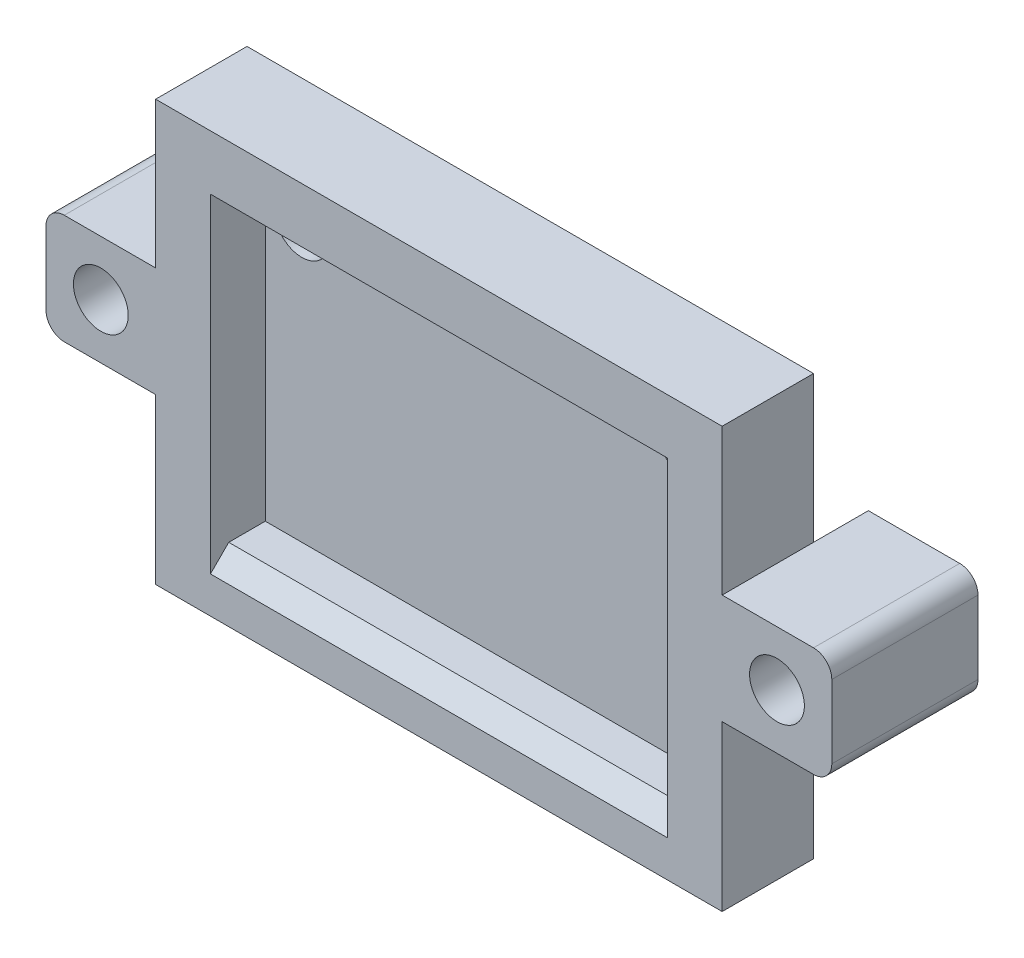
ISO-10303-21;
HEADER;
FILE_DESCRIPTION(('STEP AP214'),'2;1');
FILE_NAME('part.step','',(''),(''),'','','');
FILE_SCHEMA(('AUTOMOTIVE_DESIGN { 1 0 10303 214 1 1 1 1 }'));
ENDSEC;
DATA;
#1=APPLICATION_CONTEXT('core data for automotive mechanical design processes');
#2=APPLICATION_PROTOCOL_DEFINITION('international standard','automotive_design',2000,#1);
#3=PRODUCT_CONTEXT('',#1,'mechanical');
#4=PRODUCT('Part','Part','',(#3));
#5=PRODUCT_RELATED_PRODUCT_CATEGORY('part','',(#4));
#6=PRODUCT_DEFINITION_FORMATION('','',#4);
#7=PRODUCT_DEFINITION_CONTEXT('part definition',#1,'design');
#8=PRODUCT_DEFINITION('design','',#6,#7);
#9=PRODUCT_DEFINITION_SHAPE('','',#8);
#10=(LENGTH_UNIT() NAMED_UNIT(*) SI_UNIT(.MILLI.,.METRE.));
#11=(NAMED_UNIT(*) PLANE_ANGLE_UNIT() SI_UNIT($,.RADIAN.));
#12=(NAMED_UNIT(*) SI_UNIT($,.STERADIAN.) SOLID_ANGLE_UNIT());
#13=UNCERTAINTY_MEASURE_WITH_UNIT(LENGTH_MEASURE(1.E-05),#10,'distance_accuracy_value','');
#14=(GEOMETRIC_REPRESENTATION_CONTEXT(3) GLOBAL_UNCERTAINTY_ASSIGNED_CONTEXT((#13)) GLOBAL_UNIT_ASSIGNED_CONTEXT((#10,
#11,#12)) REPRESENTATION_CONTEXT('',''));
#15=CARTESIAN_POINT('',(0.,0.,0.));
#16=DIRECTION('',(0.,0.,1.));
#17=DIRECTION('',(1.,0.,0.));
#18=AXIS2_PLACEMENT_3D('',#15,#16,#17);
#19=CARTESIAN_POINT('',(0.,23.,5.));
#20=DIRECTION('',(-1.,0.,0.));
#21=DIRECTION('',(0.,0.,1.));
#22=AXIS2_PLACEMENT_3D('',#19,#20,#21);
#23=PLANE('',#22);
#24=DIRECTION('',(0.,0.,1.));
#25=VECTOR('',#24,1.);
#26=CARTESIAN_POINT('',(0.,15.,-3.));
#27=LINE('',#26,#25);
#28=CARTESIAN_POINT('',(0.,15.,0.));
#29=VERTEX_POINT('',#28);
#30=CARTESIAN_POINT('',(0.,15.,5.));
#31=VERTEX_POINT('',#30);
#32=EDGE_CURVE('E227',#29,#31,#27,.T.);
#33=ORIENTED_EDGE('',*,*,#32,.F.);
#34=DIRECTION('',(0.,1.,0.));
#35=VECTOR('',#34,1.);
#36=CARTESIAN_POINT('',(0.,23.,0.));
#37=LINE('',#36,#35);
#38=CARTESIAN_POINT('',(0.,23.,0.));
#39=VERTEX_POINT('',#38);
#40=EDGE_CURVE('E308',#29,#39,#37,.T.);
#41=ORIENTED_EDGE('',*,*,#40,.T.);
#42=DIRECTION('',(0.,0.,-1.));
#43=VECTOR('',#42,1.);
#44=CARTESIAN_POINT('',(0.,23.,5.));
#45=LINE('',#44,#43);
#46=CARTESIAN_POINT('',(0.,23.,5.));
#47=VERTEX_POINT('',#46);
#48=EDGE_CURVE('E317',#47,#39,#45,.T.);
#49=ORIENTED_EDGE('',*,*,#48,.F.);
#50=DIRECTION('',(0.,1.,0.));
#51=VECTOR('',#50,1.);
#52=CARTESIAN_POINT('',(0.,23.,5.));
#53=LINE('',#52,#51);
#54=EDGE_CURVE('E229',#31,#47,#53,.T.);
#55=ORIENTED_EDGE('',*,*,#54,.F.);
#56=EDGE_LOOP('',(#33,#41,#49,#55));
#57=FACE_BOUND('',#56,.T.);
#58=ADVANCED_FACE('F33',(#57),#23,.F.);
#59=CARTESIAN_POINT('',(-31.,23.,5.));
#60=DIRECTION('',(1.,0.,0.));
#61=DIRECTION('',(0.,1.,0.));
#62=AXIS2_PLACEMENT_3D('',#59,#60,#61);
#63=PLANE('',#62);
#64=DIRECTION('',(0.,0.,1.));
#65=VECTOR('',#64,1.);
#66=CARTESIAN_POINT('',(-31.,9.,-3.));
#67=LINE('',#66,#65);
#68=CARTESIAN_POINT('',(-31.,9.,0.));
#69=VERTEX_POINT('',#68);
#70=CARTESIAN_POINT('',(-31.,9.,5.));
#71=VERTEX_POINT('',#70);
#72=EDGE_CURVE('E228',#69,#71,#67,.T.);
#73=ORIENTED_EDGE('',*,*,#72,.F.);
#74=DIRECTION('',(0.,-1.,0.));
#75=VECTOR('',#74,1.);
#76=CARTESIAN_POINT('',(-31.,23.,0.));
#77=LINE('',#76,#75);
#78=CARTESIAN_POINT('',(-31.,0.,0.));
#79=VERTEX_POINT('',#78);
#80=EDGE_CURVE('E306',#69,#79,#77,.T.);
#81=ORIENTED_EDGE('',*,*,#80,.T.);
#82=DIRECTION('',(0.,0.,-1.));
#83=VECTOR('',#82,1.);
#84=CARTESIAN_POINT('',(-31.,0.,5.));
#85=LINE('',#84,#83);
#86=CARTESIAN_POINT('',(-31.,0.,5.));
#87=VERTEX_POINT('',#86);
#88=EDGE_CURVE('E322',#87,#79,#85,.T.);
#89=ORIENTED_EDGE('',*,*,#88,.F.);
#90=DIRECTION('',(0.,-1.,0.));
#91=VECTOR('',#90,1.);
#92=CARTESIAN_POINT('',(-31.,23.,5.));
#93=LINE('',#92,#91);
#94=EDGE_CURVE('E314',#71,#87,#93,.T.);
#95=ORIENTED_EDGE('',*,*,#94,.F.);
#96=EDGE_LOOP('',(#73,#81,#89,#95));
#97=FACE_BOUND('',#96,.T.);
#98=ADVANCED_FACE('F447',(#97),#63,.F.);
#99=CARTESIAN_POINT('',(-31.,23.,0.));
#100=VERTEX_POINT('',#99);
#101=CARTESIAN_POINT('',(-31.,15.,0.));
#102=VERTEX_POINT('',#101);
#103=EDGE_CURVE('E301',#100,#102,#77,.T.);
#104=ORIENTED_EDGE('',*,*,#103,.T.);
#105=DIRECTION('',(0.,0.,1.));
#106=VECTOR('',#105,1.);
#107=CARTESIAN_POINT('',(-31.,15.,-3.));
#108=LINE('',#107,#106);
#109=CARTESIAN_POINT('',(-31.,15.,5.));
#110=VERTEX_POINT('',#109);
#111=EDGE_CURVE('E325',#102,#110,#108,.T.);
#112=ORIENTED_EDGE('',*,*,#111,.T.);
#113=CARTESIAN_POINT('',(-31.,23.,5.));
#114=VERTEX_POINT('',#113);
#115=EDGE_CURVE('E326',#114,#110,#93,.T.);
#116=ORIENTED_EDGE('',*,*,#115,.F.);
#117=DIRECTION('',(0.,0.,-1.));
#118=VECTOR('',#117,1.);
#119=CARTESIAN_POINT('',(-31.,23.,5.));
#120=LINE('',#119,#118);
#121=EDGE_CURVE('E292',#114,#100,#120,.T.);
#122=ORIENTED_EDGE('',*,*,#121,.T.);
#123=EDGE_LOOP('',(#104,#112,#116,#122));
#124=FACE_BOUND('',#123,.T.);
#125=ADVANCED_FACE('F454',(#124),#63,.F.);
#126=CARTESIAN_POINT('',(-31.,0.,5.));
#127=DIRECTION('',(0.,1.,0.));
#128=DIRECTION('',(0.,0.,1.));
#129=AXIS2_PLACEMENT_3D('',#126,#127,#128);
#130=PLANE('',#129);
#131=DIRECTION('',(1.,0.,0.));
#132=VECTOR('',#131,1.);
#133=CARTESIAN_POINT('',(-31.,0.,0.));
#134=LINE('',#133,#132);
#135=CARTESIAN_POINT('',(0.,0.,0.));
#136=VERTEX_POINT('',#135);
#137=EDGE_CURVE('E304',#79,#136,#134,.T.);
#138=ORIENTED_EDGE('',*,*,#137,.T.);
#139=DIRECTION('',(0.,0.,-1.));
#140=VECTOR('',#139,1.);
#141=CARTESIAN_POINT('',(0.,0.,5.));
#142=LINE('',#141,#140);
#143=CARTESIAN_POINT('',(0.,0.,5.));
#144=VERTEX_POINT('',#143);
#145=EDGE_CURVE('E320',#144,#136,#142,.T.);
#146=ORIENTED_EDGE('',*,*,#145,.F.);
#147=DIRECTION('',(1.,0.,0.));
#148=VECTOR('',#147,1.);
#149=CARTESIAN_POINT('',(-31.,0.,5.));
#150=LINE('',#149,#148);
#151=EDGE_CURVE('E287',#87,#144,#150,.T.);
#152=ORIENTED_EDGE('',*,*,#151,.F.);
#153=ORIENTED_EDGE('',*,*,#88,.T.);
#154=EDGE_LOOP('',(#138,#146,#152,#153));
#155=FACE_BOUND('',#154,.T.);
#156=ADVANCED_FACE('F460',(#155),#130,.F.);
#157=CARTESIAN_POINT('',(0.,9.,0.));
#158=VERTEX_POINT('',#157);
#159=EDGE_CURVE('E309',#136,#158,#37,.T.);
#160=ORIENTED_EDGE('',*,*,#159,.T.);
#161=DIRECTION('',(0.,0.,1.));
#162=VECTOR('',#161,1.);
#163=CARTESIAN_POINT('',(0.,9.,-3.));
#164=LINE('',#163,#162);
#165=CARTESIAN_POINT('',(0.,9.,5.));
#166=VERTEX_POINT('',#165);
#167=EDGE_CURVE('E223',#158,#166,#164,.T.);
#168=ORIENTED_EDGE('',*,*,#167,.T.);
#169=EDGE_CURVE('E285',#144,#166,#53,.T.);
#170=ORIENTED_EDGE('',*,*,#169,.F.);
#171=ORIENTED_EDGE('',*,*,#145,.T.);
#172=EDGE_LOOP('',(#160,#168,#170,#171));
#173=FACE_BOUND('',#172,.T.);
#174=ADVANCED_FACE('F450',(#173),#23,.F.);
#175=CARTESIAN_POINT('',(-31.,23.,5.));
#176=DIRECTION('',(0.,-1.,0.));
#177=DIRECTION('',(1.,0.,0.));
#178=AXIS2_PLACEMENT_3D('',#175,#176,#177);
#179=PLANE('',#178);
#180=DIRECTION('',(-1.,0.,0.));
#181=VECTOR('',#180,1.);
#182=CARTESIAN_POINT('',(-31.,23.,0.));
#183=LINE('',#182,#181);
#184=EDGE_CURVE('E312',#39,#100,#183,.T.);
#185=ORIENTED_EDGE('',*,*,#184,.T.);
#186=ORIENTED_EDGE('',*,*,#121,.F.);
#187=DIRECTION('',(-1.,0.,0.));
#188=VECTOR('',#187,1.);
#189=CARTESIAN_POINT('',(-31.,23.,5.));
#190=LINE('',#189,#188);
#191=EDGE_CURVE('E291',#47,#114,#190,.T.);
#192=ORIENTED_EDGE('',*,*,#191,.F.);
#193=ORIENTED_EDGE('',*,*,#48,.T.);
#194=EDGE_LOOP('',(#185,#186,#192,#193));
#195=FACE_BOUND('',#194,.T.);
#196=ADVANCED_FACE('F459',(#195),#179,.F.);
#197=CARTESIAN_POINT('',(0.,0.,5.));
#198=DIRECTION('',(0.,0.,1.));
#199=DIRECTION('',(1.,0.,0.));
#200=AXIS2_PLACEMENT_3D('',#197,#198,#199);
#201=PLANE('',#200);
#202=CARTESIAN_POINT('',(3.,12.,5.));
#203=DIRECTION('',(0.,0.,1.));
#204=DIRECTION('',(1.,0.,0.));
#205=AXIS2_PLACEMENT_3D('',#202,#203,#204);
#206=CIRCLE('',#205,1.5);
#207=CARTESIAN_POINT('',(4.5,12.,5.));
#208=VERTEX_POINT('',#207);
#209=EDGE_CURVE('E506',#208,#208,#206,.T.);
#210=ORIENTED_EDGE('',*,*,#209,.F.);
#211=EDGE_LOOP('',(#210));
#212=FACE_BOUND('',#211,.T.);
#213=CARTESIAN_POINT('',(-34.,12.,5.));
#214=DIRECTION('',(0.,0.,1.));
#215=DIRECTION('',(1.,0.,0.));
#216=AXIS2_PLACEMENT_3D('',#213,#214,#215);
#217=CIRCLE('',#216,1.5);
#218=CARTESIAN_POINT('',(-32.5,12.,5.));
#219=VERTEX_POINT('',#218);
#220=EDGE_CURVE('E500',#219,#219,#217,.T.);
#221=ORIENTED_EDGE('',*,*,#220,.F.);
#222=EDGE_LOOP('',(#221));
#223=FACE_BOUND('',#222,.T.);
#224=DIRECTION('',(0.,1.,0.));
#225=VECTOR('',#224,1.);
#226=CARTESIAN_POINT('',(-3.,20.,5.));
#227=LINE('',#226,#225);
#228=CARTESIAN_POINT('',(-3.,2.,5.));
#229=VERTEX_POINT('',#228);
#230=CARTESIAN_POINT('',(-3.,20.,5.));
#231=VERTEX_POINT('',#230);
#232=EDGE_CURVE('E348',#229,#231,#227,.T.);
#233=ORIENTED_EDGE('',*,*,#232,.F.);
#234=DIRECTION('',(-1.,0.,0.));
#235=VECTOR('',#234,1.);
#236=CARTESIAN_POINT('',(-28.,2.,5.));
#237=LINE('',#236,#235);
#238=CARTESIAN_POINT('',(-28.,2.,5.));
#239=VERTEX_POINT('',#238);
#240=EDGE_CURVE('E413',#229,#239,#237,.T.);
#241=ORIENTED_EDGE('',*,*,#240,.T.);
#242=DIRECTION('',(0.,-1.,0.));
#243=VECTOR('',#242,1.);
#244=CARTESIAN_POINT('',(-28.,20.,5.));
#245=LINE('',#244,#243);
#246=CARTESIAN_POINT('',(-28.,20.,5.));
#247=VERTEX_POINT('',#246);
#248=EDGE_CURVE('E351',#247,#239,#245,.T.);
#249=ORIENTED_EDGE('',*,*,#248,.F.);
#250=DIRECTION('',(-1.,0.,0.));
#251=VECTOR('',#250,1.);
#252=CARTESIAN_POINT('',(-28.,20.,5.));
#253=LINE('',#252,#251);
#254=EDGE_CURVE('E344',#231,#247,#253,.T.);
#255=ORIENTED_EDGE('',*,*,#254,.F.);
#256=EDGE_LOOP('',(#233,#241,#249,#255));
#257=FACE_BOUND('',#256,.T.);
#258=DIRECTION('',(-1.,0.,0.));
#259=VECTOR('',#258,1.);
#260=CARTESIAN_POINT('',(-31.,15.,5.));
#261=LINE('',#260,#259);
#262=CARTESIAN_POINT('',(-36.,15.,5.));
#263=VERTEX_POINT('',#262);
#264=EDGE_CURVE('E219',#110,#263,#261,.T.);
#265=ORIENTED_EDGE('',*,*,#264,.T.);
#266=CARTESIAN_POINT('',(-36.,14.,5.));
#267=DIRECTION('',(0.,0.,1.));
#268=DIRECTION('',(1.,0.,0.));
#269=AXIS2_PLACEMENT_3D('',#266,#267,#268);
#270=CIRCLE('',#269,1.);
#271=CARTESIAN_POINT('',(-37.,14.,5.));
#272=VERTEX_POINT('',#271);
#273=EDGE_CURVE('E255',#263,#272,#270,.T.);
#274=ORIENTED_EDGE('',*,*,#273,.T.);
#275=DIRECTION('',(0.,-1.,0.));
#276=VECTOR('',#275,1.);
#277=CARTESIAN_POINT('',(-37.,15.,5.));
#278=LINE('',#277,#276);
#279=CARTESIAN_POINT('',(-37.,10.,5.));
#280=VERTEX_POINT('',#279);
#281=EDGE_CURVE('E375',#272,#280,#278,.T.);
#282=ORIENTED_EDGE('',*,*,#281,.T.);
#283=CARTESIAN_POINT('',(-36.,10.,5.));
#284=DIRECTION('',(0.,0.,1.));
#285=DIRECTION('',(1.,0.,0.));
#286=AXIS2_PLACEMENT_3D('',#283,#284,#285);
#287=CIRCLE('',#286,1.);
#288=CARTESIAN_POINT('',(-36.,9.,5.));
#289=VERTEX_POINT('',#288);
#290=EDGE_CURVE('E248',#280,#289,#287,.T.);
#291=ORIENTED_EDGE('',*,*,#290,.T.);
#292=DIRECTION('',(1.,0.,0.));
#293=VECTOR('',#292,1.);
#294=CARTESIAN_POINT('',(-31.,9.,5.));
#295=LINE('',#294,#293);
#296=EDGE_CURVE('E245',#289,#71,#295,.T.);
#297=ORIENTED_EDGE('',*,*,#296,.T.);
#298=ORIENTED_EDGE('',*,*,#94,.T.);
#299=ORIENTED_EDGE('',*,*,#151,.T.);
#300=ORIENTED_EDGE('',*,*,#169,.T.);
#301=DIRECTION('',(1.,0.,0.));
#302=VECTOR('',#301,1.);
#303=CARTESIAN_POINT('',(6.,9.,5.));
#304=LINE('',#303,#302);
#305=CARTESIAN_POINT('',(5.,9.,5.));
#306=VERTEX_POINT('',#305);
#307=EDGE_CURVE('E234',#166,#306,#304,.T.);
#308=ORIENTED_EDGE('',*,*,#307,.T.);
#309=CARTESIAN_POINT('',(5.,10.,5.));
#310=DIRECTION('',(0.,0.,1.));
#311=DIRECTION('',(1.,0.,0.));
#312=AXIS2_PLACEMENT_3D('',#309,#310,#311);
#313=CIRCLE('',#312,1.);
#314=CARTESIAN_POINT('',(6.,10.,5.));
#315=VERTEX_POINT('',#314);
#316=EDGE_CURVE('E250',#306,#315,#313,.T.);
#317=ORIENTED_EDGE('',*,*,#316,.T.);
#318=DIRECTION('',(0.,1.,0.));
#319=VECTOR('',#318,1.);
#320=CARTESIAN_POINT('',(6.,15.,5.));
#321=LINE('',#320,#319);
#322=CARTESIAN_POINT('',(6.,14.,5.));
#323=VERTEX_POINT('',#322);
#324=EDGE_CURVE('E213',#315,#323,#321,.T.);
#325=ORIENTED_EDGE('',*,*,#324,.T.);
#326=CARTESIAN_POINT('',(5.,14.,5.));
#327=DIRECTION('',(0.,0.,1.));
#328=DIRECTION('',(1.,0.,0.));
#329=AXIS2_PLACEMENT_3D('',#326,#327,#328);
#330=CIRCLE('',#329,1.);
#331=CARTESIAN_POINT('',(5.,15.,5.));
#332=VERTEX_POINT('',#331);
#333=EDGE_CURVE('E253',#323,#332,#330,.T.);
#334=ORIENTED_EDGE('',*,*,#333,.T.);
#335=DIRECTION('',(-1.,0.,0.));
#336=VECTOR('',#335,1.);
#337=CARTESIAN_POINT('',(6.,15.,5.));
#338=LINE('',#337,#336);
#339=EDGE_CURVE('E216',#332,#31,#338,.T.);
#340=ORIENTED_EDGE('',*,*,#339,.T.);
#341=ORIENTED_EDGE('',*,*,#54,.T.);
#342=ORIENTED_EDGE('',*,*,#191,.T.);
#343=ORIENTED_EDGE('',*,*,#115,.T.);
#344=EDGE_LOOP('',(#265,#274,#282,#291,#297,#298,#299,#300,#308,#317,#325,#334,#340,#341,#342,#343));
#345=FACE_BOUND('',#344,.T.);
#346=ADVANCED_FACE('F282',(#212,#223,#257,#345),#201,.T.);
#347=CARTESIAN_POINT('',(0.,0.,0.));
#348=DIRECTION('',(0.,0.,1.));
#349=DIRECTION('',(1.,0.,0.));
#350=AXIS2_PLACEMENT_3D('',#347,#348,#349);
#351=PLANE('',#350);
#352=CARTESIAN_POINT('',(-5.,18.,0.));
#353=DIRECTION('',(0.,0.,1.));
#354=DIRECTION('',(1.,0.,0.));
#355=AXIS2_PLACEMENT_3D('',#352,#353,#354);
#356=CIRCLE('',#355,1.5);
#357=CARTESIAN_POINT('',(-3.5,18.,0.));
#358=VERTEX_POINT('',#357);
#359=EDGE_CURVE('E493',#358,#358,#356,.T.);
#360=ORIENTED_EDGE('',*,*,#359,.T.);
#361=EDGE_LOOP('',(#360));
#362=FACE_BOUND('',#361,.T.);
#363=CARTESIAN_POINT('',(-26.,18.,0.));
#364=DIRECTION('',(0.,0.,1.));
#365=DIRECTION('',(1.,0.,0.));
#366=AXIS2_PLACEMENT_3D('',#363,#364,#365);
#367=CIRCLE('',#366,1.5);
#368=CARTESIAN_POINT('',(-24.5,18.,0.));
#369=VERTEX_POINT('',#368);
#370=EDGE_CURVE('E217',#369,#369,#367,.T.);
#371=ORIENTED_EDGE('',*,*,#370,.T.);
#372=EDGE_LOOP('',(#371));
#373=FACE_BOUND('',#372,.T.);
#374=ORIENTED_EDGE('',*,*,#103,.F.);
#375=ORIENTED_EDGE('',*,*,#184,.F.);
#376=ORIENTED_EDGE('',*,*,#40,.F.);
#377=EDGE_CURVE('E204',#158,#29,#37,.T.);
#378=ORIENTED_EDGE('',*,*,#377,.F.);
#379=ORIENTED_EDGE('',*,*,#159,.F.);
#380=ORIENTED_EDGE('',*,*,#137,.F.);
#381=ORIENTED_EDGE('',*,*,#80,.F.);
#382=EDGE_CURVE('E305',#102,#69,#77,.T.);
#383=ORIENTED_EDGE('',*,*,#382,.F.);
#384=EDGE_LOOP('',(#374,#375,#376,#378,#379,#380,#381,#383));
#385=FACE_BOUND('',#384,.T.);
#386=ADVANCED_FACE('F471',(#362,#373,#385),#351,.F.);
#387=CARTESIAN_POINT('',(-28.,20.,2.));
#388=DIRECTION('',(-1.,0.,0.));
#389=DIRECTION('',(0.,-1.,0.));
#390=AXIS2_PLACEMENT_3D('',#387,#388,#389);
#391=PLANE('',#390);
#392=ORIENTED_EDGE('',*,*,#248,.T.);
#393=DIRECTION('',(0.,0.707106781186548,-0.707106781186548));
#394=VECTOR('',#393,1.);
#395=CARTESIAN_POINT('',(-28.,12.5,-5.5));
#396=LINE('',#395,#394);
#397=CARTESIAN_POINT('',(-28.,3.,4.));
#398=VERTEX_POINT('',#397);
#399=EDGE_CURVE('E408',#239,#398,#396,.T.);
#400=ORIENTED_EDGE('',*,*,#399,.T.);
#401=DIRECTION('',(0.,0.,1.));
#402=VECTOR('',#401,1.);
#403=CARTESIAN_POINT('',(-28.,3.,2.));
#404=LINE('',#403,#402);
#405=CARTESIAN_POINT('',(-28.,3.,2.));
#406=VERTEX_POINT('',#405);
#407=EDGE_CURVE('E332',#406,#398,#404,.T.);
#408=ORIENTED_EDGE('',*,*,#407,.F.);
#409=DIRECTION('',(0.,-1.,0.));
#410=VECTOR('',#409,1.);
#411=CARTESIAN_POINT('',(-28.,20.,2.));
#412=LINE('',#411,#410);
#413=CARTESIAN_POINT('',(-28.,20.,2.));
#414=VERTEX_POINT('',#413);
#415=EDGE_CURVE('E347',#414,#406,#412,.T.);
#416=ORIENTED_EDGE('',*,*,#415,.F.);
#417=DIRECTION('',(0.,0.,1.));
#418=VECTOR('',#417,1.);
#419=CARTESIAN_POINT('',(-28.,20.,2.));
#420=LINE('',#419,#418);
#421=EDGE_CURVE('E342',#414,#247,#420,.T.);
#422=ORIENTED_EDGE('',*,*,#421,.T.);
#423=EDGE_LOOP('',(#392,#400,#408,#416,#422));
#424=FACE_BOUND('',#423,.T.);
#425=ADVANCED_FACE('F433',(#424),#391,.F.);
#426=CARTESIAN_POINT('',(-28.,20.,2.));
#427=DIRECTION('',(0.,1.,0.));
#428=DIRECTION('',(-1.,0.,0.));
#429=AXIS2_PLACEMENT_3D('',#426,#427,#428);
#430=PLANE('',#429);
#431=ORIENTED_EDGE('',*,*,#254,.T.);
#432=ORIENTED_EDGE('',*,*,#421,.F.);
#433=DIRECTION('',(-1.,0.,0.));
#434=VECTOR('',#433,1.);
#435=CARTESIAN_POINT('',(-28.,20.,2.));
#436=LINE('',#435,#434);
#437=CARTESIAN_POINT('',(-3.,20.,2.));
#438=VERTEX_POINT('',#437);
#439=EDGE_CURVE('E337',#438,#414,#436,.T.);
#440=ORIENTED_EDGE('',*,*,#439,.F.);
#441=DIRECTION('',(0.,0.,1.));
#442=VECTOR('',#441,1.);
#443=CARTESIAN_POINT('',(-3.,20.,2.));
#444=LINE('',#443,#442);
#445=EDGE_CURVE('E340',#438,#231,#444,.T.);
#446=ORIENTED_EDGE('',*,*,#445,.T.);
#447=EDGE_LOOP('',(#431,#432,#440,#446));
#448=FACE_BOUND('',#447,.T.);
#449=ADVANCED_FACE('F525',(#448),#430,.F.);
#450=CARTESIAN_POINT('',(-3.,20.,2.));
#451=DIRECTION('',(1.,0.,0.));
#452=DIRECTION('',(0.,1.,0.));
#453=AXIS2_PLACEMENT_3D('',#450,#451,#452);
#454=PLANE('',#453);
#455=ORIENTED_EDGE('',*,*,#232,.T.);
#456=ORIENTED_EDGE('',*,*,#445,.F.);
#457=DIRECTION('',(0.,1.,0.));
#458=VECTOR('',#457,1.);
#459=CARTESIAN_POINT('',(-3.,20.,2.));
#460=LINE('',#459,#458);
#461=CARTESIAN_POINT('',(-3.,3.,2.));
#462=VERTEX_POINT('',#461);
#463=EDGE_CURVE('E356',#462,#438,#460,.T.);
#464=ORIENTED_EDGE('',*,*,#463,.F.);
#465=DIRECTION('',(0.,0.,1.));
#466=VECTOR('',#465,1.);
#467=CARTESIAN_POINT('',(-3.,3.,2.));
#468=LINE('',#467,#466);
#469=CARTESIAN_POINT('',(-3.,3.,4.));
#470=VERTEX_POINT('',#469);
#471=EDGE_CURVE('E336',#462,#470,#468,.T.);
#472=ORIENTED_EDGE('',*,*,#471,.T.);
#473=DIRECTION('',(0.,-0.707106781186548,0.707106781186548));
#474=VECTOR('',#473,1.);
#475=CARTESIAN_POINT('',(-3.,12.5,-5.5));
#476=LINE('',#475,#474);
#477=EDGE_CURVE('E409',#470,#229,#476,.T.);
#478=ORIENTED_EDGE('',*,*,#477,.T.);
#479=EDGE_LOOP('',(#455,#456,#464,#472,#478));
#480=FACE_BOUND('',#479,.T.);
#481=ADVANCED_FACE('F427',(#480),#454,.F.);
#482=CARTESIAN_POINT('',(-28.,3.,2.));
#483=DIRECTION('',(0.,-1.,0.));
#484=DIRECTION('',(0.,0.,-1.));
#485=AXIS2_PLACEMENT_3D('',#482,#483,#484);
#486=PLANE('',#485);
#487=ORIENTED_EDGE('',*,*,#407,.T.);
#488=DIRECTION('',(1.,0.,0.));
#489=VECTOR('',#488,1.);
#490=CARTESIAN_POINT('',(-3.,3.,4.));
#491=LINE('',#490,#489);
#492=EDGE_CURVE('E233',#398,#470,#491,.T.);
#493=ORIENTED_EDGE('',*,*,#492,.T.);
#494=ORIENTED_EDGE('',*,*,#471,.F.);
#495=DIRECTION('',(1.,0.,0.));
#496=VECTOR('',#495,1.);
#497=CARTESIAN_POINT('',(-28.,3.,2.));
#498=LINE('',#497,#496);
#499=EDGE_CURVE('E359',#406,#462,#498,.T.);
#500=ORIENTED_EDGE('',*,*,#499,.F.);
#501=EDGE_LOOP('',(#487,#493,#494,#500));
#502=FACE_BOUND('',#501,.T.);
#503=ADVANCED_FACE('F422',(#502),#486,.F.);
#504=CARTESIAN_POINT('',(0.,0.,2.));
#505=DIRECTION('',(0.,0.,1.));
#506=DIRECTION('',(1.,0.,0.));
#507=AXIS2_PLACEMENT_3D('',#504,#505,#506);
#508=PLANE('',#507);
#509=CARTESIAN_POINT('',(-5.,18.,2.));
#510=DIRECTION('',(0.,0.,1.));
#511=DIRECTION('',(1.,0.,0.));
#512=AXIS2_PLACEMENT_3D('',#509,#510,#511);
#513=CIRCLE('',#512,1.5);
#514=CARTESIAN_POINT('',(-3.5,18.,2.));
#515=VERTEX_POINT('',#514);
#516=EDGE_CURVE('E496',#515,#515,#513,.T.);
#517=ORIENTED_EDGE('',*,*,#516,.F.);
#518=EDGE_LOOP('',(#517));
#519=FACE_BOUND('',#518,.T.);
#520=CARTESIAN_POINT('',(-26.,18.,2.));
#521=DIRECTION('',(0.,0.,1.));
#522=DIRECTION('',(1.,0.,0.));
#523=AXIS2_PLACEMENT_3D('',#520,#521,#522);
#524=CIRCLE('',#523,1.5);
#525=CARTESIAN_POINT('',(-24.5,18.,2.));
#526=VERTEX_POINT('',#525);
#527=EDGE_CURVE('E490',#526,#526,#524,.T.);
#528=ORIENTED_EDGE('',*,*,#527,.F.);
#529=EDGE_LOOP('',(#528));
#530=FACE_BOUND('',#529,.T.);
#531=ORIENTED_EDGE('',*,*,#415,.T.);
#532=ORIENTED_EDGE('',*,*,#499,.T.);
#533=ORIENTED_EDGE('',*,*,#463,.T.);
#534=ORIENTED_EDGE('',*,*,#439,.T.);
#535=EDGE_LOOP('',(#531,#532,#533,#534));
#536=FACE_BOUND('',#535,.T.);
#537=ADVANCED_FACE('F430',(#519,#530,#536),#508,.T.);
#538=CARTESIAN_POINT('',(-31.,15.,-3.));
#539=DIRECTION('',(1.,0.,0.));
#540=DIRECTION('',(0.,0.,-1.));
#541=AXIS2_PLACEMENT_3D('',#538,#539,#540);
#542=PLANE('',#541);
#543=CARTESIAN_POINT('',(-31.,15.,-3.));
#544=VERTEX_POINT('',#543);
#545=EDGE_CURVE('E364',#544,#102,#108,.T.);
#546=ORIENTED_EDGE('',*,*,#545,.T.);
#547=ORIENTED_EDGE('',*,*,#382,.T.);
#548=CARTESIAN_POINT('',(-31.,9.,-3.));
#549=VERTEX_POINT('',#548);
#550=EDGE_CURVE('E353',#549,#69,#67,.T.);
#551=ORIENTED_EDGE('',*,*,#550,.F.);
#552=DIRECTION('',(0.,1.,0.));
#553=VECTOR('',#552,1.);
#554=CARTESIAN_POINT('',(-31.,15.,-3.));
#555=LINE('',#554,#553);
#556=EDGE_CURVE('E379',#549,#544,#555,.T.);
#557=ORIENTED_EDGE('',*,*,#556,.T.);
#558=EDGE_LOOP('',(#546,#547,#551,#557));
#559=FACE_BOUND('',#558,.T.);
#560=ADVANCED_FACE('F391',(#559),#542,.T.);
#561=CARTESIAN_POINT('',(-31.,9.,-3.));
#562=DIRECTION('',(0.,-1.,0.));
#563=DIRECTION('',(0.,0.,-1.));
#564=AXIS2_PLACEMENT_3D('',#561,#562,#563);
#565=PLANE('',#564);
#566=ORIENTED_EDGE('',*,*,#296,.F.);
#567=DIRECTION('',(0.,0.,1.));
#568=VECTOR('',#567,1.);
#569=CARTESIAN_POINT('',(-36.,9.,-3.));
#570=LINE('',#569,#568);
#571=CARTESIAN_POINT('',(-36.,9.,-3.));
#572=VERTEX_POINT('',#571);
#573=EDGE_CURVE('E11',#289,#572,#570,.F.);
#574=ORIENTED_EDGE('',*,*,#573,.T.);
#575=DIRECTION('',(1.,0.,0.));
#576=VECTOR('',#575,1.);
#577=CARTESIAN_POINT('',(-31.,9.,-3.));
#578=LINE('',#577,#576);
#579=EDGE_CURVE('E368',#572,#549,#578,.T.);
#580=ORIENTED_EDGE('',*,*,#579,.T.);
#581=ORIENTED_EDGE('',*,*,#550,.T.);
#582=ORIENTED_EDGE('',*,*,#72,.T.);
#583=EDGE_LOOP('',(#566,#574,#580,#581,#582));
#584=FACE_BOUND('',#583,.T.);
#585=ADVANCED_FACE('F573',(#584),#565,.T.);
#586=CARTESIAN_POINT('',(-37.,15.,-3.));
#587=DIRECTION('',(-1.,0.,0.));
#588=DIRECTION('',(0.,-1.,0.));
#589=AXIS2_PLACEMENT_3D('',#586,#587,#588);
#590=PLANE('',#589);
#591=ORIENTED_EDGE('',*,*,#281,.F.);
#592=DIRECTION('',(0.,0.,1.));
#593=VECTOR('',#592,1.);
#594=CARTESIAN_POINT('',(-37.,14.,-3.));
#595=LINE('',#594,#593);
#596=CARTESIAN_POINT('',(-37.,14.,-3.));
#597=VERTEX_POINT('',#596);
#598=EDGE_CURVE('E260',#272,#597,#595,.F.);
#599=ORIENTED_EDGE('',*,*,#598,.T.);
#600=DIRECTION('',(0.,-1.,0.));
#601=VECTOR('',#600,1.);
#602=CARTESIAN_POINT('',(-37.,15.,-3.));
#603=LINE('',#602,#601);
#604=CARTESIAN_POINT('',(-37.,10.,-3.));
#605=VERTEX_POINT('',#604);
#606=EDGE_CURVE('E382',#597,#605,#603,.T.);
#607=ORIENTED_EDGE('',*,*,#606,.T.);
#608=DIRECTION('',(0.,0.,1.));
#609=VECTOR('',#608,1.);
#610=CARTESIAN_POINT('',(-37.,10.,-3.));
#611=LINE('',#610,#609);
#612=EDGE_CURVE('E257',#605,#280,#611,.T.);
#613=ORIENTED_EDGE('',*,*,#612,.T.);
#614=EDGE_LOOP('',(#591,#599,#607,#613));
#615=FACE_BOUND('',#614,.T.);
#616=ADVANCED_FACE('F576',(#615),#590,.T.);
#617=CARTESIAN_POINT('',(-31.,15.,-3.));
#618=DIRECTION('',(0.,1.,0.));
#619=DIRECTION('',(-1.,0.,0.));
#620=AXIS2_PLACEMENT_3D('',#617,#618,#619);
#621=PLANE('',#620);
#622=DIRECTION('',(-1.,0.,0.));
#623=VECTOR('',#622,1.);
#624=CARTESIAN_POINT('',(-31.,15.,-3.));
#625=LINE('',#624,#623);
#626=CARTESIAN_POINT('',(-36.,15.,-3.));
#627=VERTEX_POINT('',#626);
#628=EDGE_CURVE('E385',#544,#627,#625,.T.);
#629=ORIENTED_EDGE('',*,*,#628,.T.);
#630=DIRECTION('',(0.,0.,1.));
#631=VECTOR('',#630,1.);
#632=CARTESIAN_POINT('',(-36.,15.,-3.));
#633=LINE('',#632,#631);
#634=EDGE_CURVE('E251',#627,#263,#633,.T.);
#635=ORIENTED_EDGE('',*,*,#634,.T.);
#636=ORIENTED_EDGE('',*,*,#264,.F.);
#637=ORIENTED_EDGE('',*,*,#111,.F.);
#638=ORIENTED_EDGE('',*,*,#545,.F.);
#639=EDGE_LOOP('',(#629,#635,#636,#637,#638));
#640=FACE_BOUND('',#639,.T.);
#641=ADVANCED_FACE('F404',(#640),#621,.T.);
#642=CARTESIAN_POINT('',(0.,0.,-3.));
#643=DIRECTION('',(0.,0.,-1.));
#644=DIRECTION('',(-1.,0.,0.));
#645=AXIS2_PLACEMENT_3D('',#642,#643,#644);
#646=PLANE('',#645);
#647=CARTESIAN_POINT('',(-34.,12.,-3.));
#648=DIRECTION('',(0.,0.,1.));
#649=DIRECTION('',(1.,0.,0.));
#650=AXIS2_PLACEMENT_3D('',#647,#648,#649);
#651=CIRCLE('',#650,1.5);
#652=CARTESIAN_POINT('',(-32.5,12.,-3.));
#653=VERTEX_POINT('',#652);
#654=EDGE_CURVE('E499',#653,#653,#651,.T.);
#655=ORIENTED_EDGE('',*,*,#654,.T.);
#656=EDGE_LOOP('',(#655));
#657=FACE_BOUND('',#656,.T.);
#658=ORIENTED_EDGE('',*,*,#606,.F.);
#659=CARTESIAN_POINT('',(-36.,14.,-3.));
#660=DIRECTION('',(0.,0.,-1.));
#661=DIRECTION('',(-1.,0.,0.));
#662=AXIS2_PLACEMENT_3D('',#659,#660,#661);
#663=CIRCLE('',#662,1.);
#664=EDGE_CURVE('E264',#597,#627,#663,.T.);
#665=ORIENTED_EDGE('',*,*,#664,.T.);
#666=ORIENTED_EDGE('',*,*,#628,.F.);
#667=ORIENTED_EDGE('',*,*,#556,.F.);
#668=ORIENTED_EDGE('',*,*,#579,.F.);
#669=CARTESIAN_POINT('',(-36.,10.,-3.));
#670=DIRECTION('',(0.,0.,-1.));
#671=DIRECTION('',(-1.,0.,0.));
#672=AXIS2_PLACEMENT_3D('',#669,#670,#671);
#673=CIRCLE('',#672,1.);
#674=EDGE_CURVE('E262',#572,#605,#673,.T.);
#675=ORIENTED_EDGE('',*,*,#674,.T.);
#676=EDGE_LOOP('',(#658,#665,#666,#667,#668,#675));
#677=FACE_BOUND('',#676,.T.);
#678=ADVANCED_FACE('F398',(#657,#677),#646,.T.);
#679=CARTESIAN_POINT('',(6.,15.,-3.));
#680=DIRECTION('',(1.,0.,0.));
#681=DIRECTION('',(0.,0.,-1.));
#682=AXIS2_PLACEMENT_3D('',#679,#680,#681);
#683=PLANE('',#682);
#684=DIRECTION('',(0.,1.,0.));
#685=VECTOR('',#684,1.);
#686=CARTESIAN_POINT('',(6.,15.,-3.));
#687=LINE('',#686,#685);
#688=CARTESIAN_POINT('',(6.,10.,-3.));
#689=VERTEX_POINT('',#688);
#690=CARTESIAN_POINT('',(6.,14.,-3.));
#691=VERTEX_POINT('',#690);
#692=EDGE_CURVE('E197',#689,#691,#687,.T.);
#693=ORIENTED_EDGE('',*,*,#692,.T.);
#694=DIRECTION('',(0.,0.,1.));
#695=VECTOR('',#694,1.);
#696=CARTESIAN_POINT('',(6.,14.,-3.));
#697=LINE('',#696,#695);
#698=EDGE_CURVE('E268',#691,#323,#697,.T.);
#699=ORIENTED_EDGE('',*,*,#698,.T.);
#700=ORIENTED_EDGE('',*,*,#324,.F.);
#701=DIRECTION('',(0.,0.,1.));
#702=VECTOR('',#701,1.);
#703=CARTESIAN_POINT('',(6.,10.,-3.));
#704=LINE('',#703,#702);
#705=EDGE_CURVE('E266',#315,#689,#704,.F.);
#706=ORIENTED_EDGE('',*,*,#705,.T.);
#707=EDGE_LOOP('',(#693,#699,#700,#706));
#708=FACE_BOUND('',#707,.T.);
#709=ADVANCED_FACE('F485',(#708),#683,.T.);
#710=CARTESIAN_POINT('',(6.,9.,-3.));
#711=DIRECTION('',(0.,-1.,0.));
#712=DIRECTION('',(0.,0.,-1.));
#713=AXIS2_PLACEMENT_3D('',#710,#711,#712);
#714=PLANE('',#713);
#715=DIRECTION('',(1.,0.,0.));
#716=VECTOR('',#715,1.);
#717=CARTESIAN_POINT('',(6.,9.,-3.));
#718=LINE('',#717,#716);
#719=CARTESIAN_POINT('',(0.,9.,-3.));
#720=VERTEX_POINT('',#719);
#721=CARTESIAN_POINT('',(5.,9.,-3.));
#722=VERTEX_POINT('',#721);
#723=EDGE_CURVE('E206',#720,#722,#718,.T.);
#724=ORIENTED_EDGE('',*,*,#723,.T.);
#725=DIRECTION('',(0.,0.,1.));
#726=VECTOR('',#725,1.);
#727=CARTESIAN_POINT('',(5.,9.,-3.));
#728=LINE('',#727,#726);
#729=EDGE_CURVE('E41',#722,#306,#728,.T.);
#730=ORIENTED_EDGE('',*,*,#729,.T.);
#731=ORIENTED_EDGE('',*,*,#307,.F.);
#732=ORIENTED_EDGE('',*,*,#167,.F.);
#733=EDGE_CURVE('E205',#720,#158,#164,.T.);
#734=ORIENTED_EDGE('',*,*,#733,.F.);
#735=EDGE_LOOP('',(#724,#730,#731,#732,#734));
#736=FACE_BOUND('',#735,.T.);
#737=ADVANCED_FACE('F277',(#736),#714,.T.);
#738=CARTESIAN_POINT('',(0.,15.,-3.));
#739=DIRECTION('',(-1.,0.,0.));
#740=DIRECTION('',(0.,-1.,0.));
#741=AXIS2_PLACEMENT_3D('',#738,#739,#740);
#742=PLANE('',#741);
#743=ORIENTED_EDGE('',*,*,#733,.T.);
#744=ORIENTED_EDGE('',*,*,#377,.T.);
#745=CARTESIAN_POINT('',(0.,15.,-3.));
#746=VERTEX_POINT('',#745);
#747=EDGE_CURVE('E192',#746,#29,#27,.T.);
#748=ORIENTED_EDGE('',*,*,#747,.F.);
#749=DIRECTION('',(0.,-1.,0.));
#750=VECTOR('',#749,1.);
#751=CARTESIAN_POINT('',(0.,15.,-3.));
#752=LINE('',#751,#750);
#753=EDGE_CURVE('E196',#746,#720,#752,.T.);
#754=ORIENTED_EDGE('',*,*,#753,.T.);
#755=EDGE_LOOP('',(#743,#744,#748,#754));
#756=FACE_BOUND('',#755,.T.);
#757=ADVANCED_FACE('F202',(#756),#742,.T.);
#758=CARTESIAN_POINT('',(6.,15.,-3.));
#759=DIRECTION('',(0.,1.,0.));
#760=DIRECTION('',(0.,0.,1.));
#761=AXIS2_PLACEMENT_3D('',#758,#759,#760);
#762=PLANE('',#761);
#763=ORIENTED_EDGE('',*,*,#339,.F.);
#764=DIRECTION('',(0.,0.,1.));
#765=VECTOR('',#764,1.);
#766=CARTESIAN_POINT('',(5.,15.,-3.));
#767=LINE('',#766,#765);
#768=CARTESIAN_POINT('',(5.,15.,-3.));
#769=VERTEX_POINT('',#768);
#770=EDGE_CURVE('E56',#332,#769,#767,.F.);
#771=ORIENTED_EDGE('',*,*,#770,.T.);
#772=DIRECTION('',(-1.,0.,0.));
#773=VECTOR('',#772,1.);
#774=CARTESIAN_POINT('',(6.,15.,-3.));
#775=LINE('',#774,#773);
#776=EDGE_CURVE('E188',#769,#746,#775,.T.);
#777=ORIENTED_EDGE('',*,*,#776,.T.);
#778=ORIENTED_EDGE('',*,*,#747,.T.);
#779=ORIENTED_EDGE('',*,*,#32,.T.);
#780=EDGE_LOOP('',(#763,#771,#777,#778,#779));
#781=FACE_BOUND('',#780,.T.);
#782=ADVANCED_FACE('F190',(#781),#762,.T.);
#783=CARTESIAN_POINT('',(0.,0.,-3.));
#784=DIRECTION('',(0.,0.,-1.));
#785=DIRECTION('',(-1.,0.,0.));
#786=AXIS2_PLACEMENT_3D('',#783,#784,#785);
#787=PLANE('',#786);
#788=CARTESIAN_POINT('',(3.,12.,-3.));
#789=DIRECTION('',(0.,0.,1.));
#790=DIRECTION('',(1.,0.,0.));
#791=AXIS2_PLACEMENT_3D('',#788,#789,#790);
#792=CIRCLE('',#791,1.5);
#793=CARTESIAN_POINT('',(4.5,12.,-3.));
#794=VERTEX_POINT('',#793);
#795=EDGE_CURVE('E503',#794,#794,#792,.T.);
#796=ORIENTED_EDGE('',*,*,#795,.T.);
#797=EDGE_LOOP('',(#796));
#798=FACE_BOUND('',#797,.T.);
#799=ORIENTED_EDGE('',*,*,#776,.F.);
#800=CARTESIAN_POINT('',(5.,14.,-3.));
#801=DIRECTION('',(0.,0.,-1.));
#802=DIRECTION('',(-1.,0.,0.));
#803=AXIS2_PLACEMENT_3D('',#800,#801,#802);
#804=CIRCLE('',#803,1.);
#805=EDGE_CURVE('E273',#769,#691,#804,.T.);
#806=ORIENTED_EDGE('',*,*,#805,.T.);
#807=ORIENTED_EDGE('',*,*,#692,.F.);
#808=CARTESIAN_POINT('',(5.,10.,-3.));
#809=DIRECTION('',(0.,0.,-1.));
#810=DIRECTION('',(-1.,0.,0.));
#811=AXIS2_PLACEMENT_3D('',#808,#809,#810);
#812=CIRCLE('',#811,1.);
#813=EDGE_CURVE('E48',#689,#722,#812,.T.);
#814=ORIENTED_EDGE('',*,*,#813,.T.);
#815=ORIENTED_EDGE('',*,*,#723,.F.);
#816=ORIENTED_EDGE('',*,*,#753,.F.);
#817=EDGE_LOOP('',(#799,#806,#807,#814,#815,#816));
#818=FACE_BOUND('',#817,.T.);
#819=ADVANCED_FACE('F208',(#798,#818),#787,.T.);
#820=CARTESIAN_POINT('',(-28.,3.,4.));
#821=DIRECTION('',(0.,0.707106781186547,0.707106781186547));
#822=DIRECTION('',(-1.,0.,0.));
#823=AXIS2_PLACEMENT_3D('',#820,#821,#822);
#824=PLANE('',#823);
#825=ORIENTED_EDGE('',*,*,#399,.F.);
#826=ORIENTED_EDGE('',*,*,#240,.F.);
#827=ORIENTED_EDGE('',*,*,#477,.F.);
#828=ORIENTED_EDGE('',*,*,#492,.F.);
#829=EDGE_LOOP('',(#825,#826,#827,#828));
#830=FACE_BOUND('',#829,.T.);
#831=ADVANCED_FACE('F434',(#830),#824,.T.);
#832=CARTESIAN_POINT('',(-36.,14.,-3.));
#833=DIRECTION('',(0.,0.,1.));
#834=DIRECTION('',(1.,0.,0.));
#835=AXIS2_PLACEMENT_3D('',#832,#833,#834);
#836=CYLINDRICAL_SURFACE('',#835,1.);
#837=ORIENTED_EDGE('',*,*,#664,.F.);
#838=ORIENTED_EDGE('',*,*,#598,.F.);
#839=ORIENTED_EDGE('',*,*,#273,.F.);
#840=ORIENTED_EDGE('',*,*,#634,.F.);
#841=EDGE_LOOP('',(#837,#838,#839,#840));
#842=FACE_BOUND('',#841,.T.);
#843=ADVANCED_FACE('F406',(#842),#836,.T.);
#844=CARTESIAN_POINT('',(5.,14.,-3.));
#845=DIRECTION('',(0.,0.,1.));
#846=DIRECTION('',(1.,0.,0.));
#847=AXIS2_PLACEMENT_3D('',#844,#845,#846);
#848=CYLINDRICAL_SURFACE('',#847,1.);
#849=ORIENTED_EDGE('',*,*,#805,.F.);
#850=ORIENTED_EDGE('',*,*,#770,.F.);
#851=ORIENTED_EDGE('',*,*,#333,.F.);
#852=ORIENTED_EDGE('',*,*,#698,.F.);
#853=EDGE_LOOP('',(#849,#850,#851,#852));
#854=FACE_BOUND('',#853,.T.);
#855=ADVANCED_FACE('F441',(#854),#848,.T.);
#856=CARTESIAN_POINT('',(5.,10.,-3.));
#857=DIRECTION('',(0.,0.,1.));
#858=DIRECTION('',(1.,0.,0.));
#859=AXIS2_PLACEMENT_3D('',#856,#857,#858);
#860=CYLINDRICAL_SURFACE('',#859,1.);
#861=ORIENTED_EDGE('',*,*,#813,.F.);
#862=ORIENTED_EDGE('',*,*,#705,.F.);
#863=ORIENTED_EDGE('',*,*,#316,.F.);
#864=ORIENTED_EDGE('',*,*,#729,.F.);
#865=EDGE_LOOP('',(#861,#862,#863,#864));
#866=FACE_BOUND('',#865,.T.);
#867=ADVANCED_FACE('F558',(#866),#860,.T.);
#868=CARTESIAN_POINT('',(-36.,10.,-3.));
#869=DIRECTION('',(0.,0.,1.));
#870=DIRECTION('',(1.,0.,0.));
#871=AXIS2_PLACEMENT_3D('',#868,#869,#870);
#872=CYLINDRICAL_SURFACE('',#871,1.);
#873=ORIENTED_EDGE('',*,*,#674,.F.);
#874=ORIENTED_EDGE('',*,*,#573,.F.);
#875=ORIENTED_EDGE('',*,*,#290,.F.);
#876=ORIENTED_EDGE('',*,*,#612,.F.);
#877=EDGE_LOOP('',(#873,#874,#875,#876));
#878=FACE_BOUND('',#877,.T.);
#879=ADVANCED_FACE('F35',(#878),#872,.T.);
#880=CARTESIAN_POINT('',(-26.,18.,-1.));
#881=DIRECTION('',(0.,0.,1.));
#882=DIRECTION('',(1.,0.,0.));
#883=AXIS2_PLACEMENT_3D('',#880,#881,#882);
#884=CYLINDRICAL_SURFACE('',#883,1.5);
#885=ORIENTED_EDGE('',*,*,#527,.T.);
#886=EDGE_LOOP('',(#885));
#887=FACE_BOUND('',#886,.T.);
#888=ORIENTED_EDGE('',*,*,#370,.F.);
#889=EDGE_LOOP('',(#888));
#890=FACE_BOUND('',#889,.T.);
#891=ADVANCED_FACE('F547',(#887,#890),#884,.F.);
#892=CARTESIAN_POINT('',(-5.,18.,-1.));
#893=DIRECTION('',(0.,0.,1.));
#894=DIRECTION('',(1.,0.,0.));
#895=AXIS2_PLACEMENT_3D('',#892,#893,#894);
#896=CYLINDRICAL_SURFACE('',#895,1.5);
#897=ORIENTED_EDGE('',*,*,#516,.T.);
#898=EDGE_LOOP('',(#897));
#899=FACE_BOUND('',#898,.T.);
#900=ORIENTED_EDGE('',*,*,#359,.F.);
#901=EDGE_LOOP('',(#900));
#902=FACE_BOUND('',#901,.T.);
#903=ADVANCED_FACE('F549',(#899,#902),#896,.F.);
#904=CARTESIAN_POINT('',(-34.,12.,-3.));
#905=DIRECTION('',(0.,0.,1.));
#906=DIRECTION('',(1.,0.,0.));
#907=AXIS2_PLACEMENT_3D('',#904,#905,#906);
#908=CYLINDRICAL_SURFACE('',#907,1.5);
#909=ORIENTED_EDGE('',*,*,#654,.F.);
#910=EDGE_LOOP('',(#909));
#911=FACE_BOUND('',#910,.T.);
#912=ORIENTED_EDGE('',*,*,#220,.T.);
#913=EDGE_LOOP('',(#912));
#914=FACE_BOUND('',#913,.T.);
#915=ADVANCED_FACE('F515',(#911,#914),#908,.F.);
#916=CARTESIAN_POINT('',(3.,12.,-3.));
#917=DIRECTION('',(0.,0.,1.));
#918=DIRECTION('',(1.,0.,0.));
#919=AXIS2_PLACEMENT_3D('',#916,#917,#918);
#920=CYLINDRICAL_SURFACE('',#919,1.5);
#921=ORIENTED_EDGE('',*,*,#795,.F.);
#922=EDGE_LOOP('',(#921));
#923=FACE_BOUND('',#922,.T.);
#924=ORIENTED_EDGE('',*,*,#209,.T.);
#925=EDGE_LOOP('',(#924));
#926=FACE_BOUND('',#925,.T.);
#927=ADVANCED_FACE('F512',(#923,#926),#920,.F.);
#928=CLOSED_SHELL('',(#58,#98,#125,#156,#174,#196,#346,#386,#425,#449,#481,#503,#537,#560,#585,
#616,#641,#678,#709,#737,#757,#782,#819,#831,#843,#855,#867,#879,#891,#903,#915,#927));
#929=MANIFOLD_SOLID_BREP('B2',#928);
#930=ADVANCED_BREP_SHAPE_REPRESENTATION('',(#18,#929),#14);
#931=SHAPE_DEFINITION_REPRESENTATION(#9,#930);
ENDSEC;
END-ISO-10303-21;
